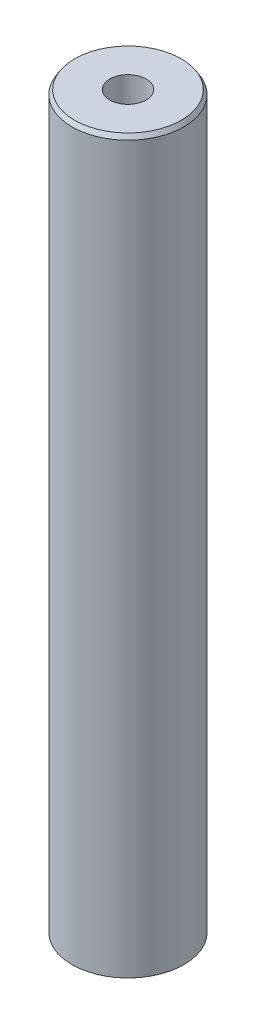
ISO-10303-21;
HEADER;
FILE_DESCRIPTION(('STEP AP214'),'2;1');
FILE_NAME('part.step','',(''),(''),'','','');
FILE_SCHEMA(('AUTOMOTIVE_DESIGN { 1 0 10303 214 1 1 1 1 }'));
ENDSEC;
DATA;
#1=APPLICATION_CONTEXT('core data for automotive mechanical design processes');
#2=APPLICATION_PROTOCOL_DEFINITION('international standard','automotive_design',2000,#1);
#3=PRODUCT_CONTEXT('',#1,'mechanical');
#4=PRODUCT('Part','Part','',(#3));
#5=PRODUCT_RELATED_PRODUCT_CATEGORY('part','',(#4));
#6=PRODUCT_DEFINITION_FORMATION('','',#4);
#7=PRODUCT_DEFINITION_CONTEXT('part definition',#1,'design');
#8=PRODUCT_DEFINITION('design','',#6,#7);
#9=PRODUCT_DEFINITION_SHAPE('','',#8);
#10=(LENGTH_UNIT() NAMED_UNIT(*) SI_UNIT(.MILLI.,.METRE.));
#11=(NAMED_UNIT(*) PLANE_ANGLE_UNIT() SI_UNIT($,.RADIAN.));
#12=(NAMED_UNIT(*) SI_UNIT($,.STERADIAN.) SOLID_ANGLE_UNIT());
#13=UNCERTAINTY_MEASURE_WITH_UNIT(LENGTH_MEASURE(1.E-05),#10,'distance_accuracy_value','');
#14=(GEOMETRIC_REPRESENTATION_CONTEXT(3) GLOBAL_UNCERTAINTY_ASSIGNED_CONTEXT((#13)) GLOBAL_UNIT_ASSIGNED_CONTEXT((#10,
#11,#12)) REPRESENTATION_CONTEXT('',''));
#15=CARTESIAN_POINT('',(0.,0.,0.));
#16=DIRECTION('',(0.,0.,1.));
#17=DIRECTION('',(1.,0.,0.));
#18=AXIS2_PLACEMENT_3D('',#15,#16,#17);
#19=CARTESIAN_POINT('',(0.,457.979607841957,0.));
#20=DIRECTION('',(0.,-1.,0.));
#21=DIRECTION('',(0.,0.,-1.));
#22=AXIS2_PLACEMENT_3D('',#19,#20,#21);
#23=CYLINDRICAL_SURFACE('',#22,35.);
#24=CARTESIAN_POINT('',(0.,455.256707147034,0.));
#25=DIRECTION('',(0.,1.,0.));
#26=DIRECTION('',(0.,0.,1.));
#27=AXIS2_PLACEMENT_3D('',#24,#25,#26);
#28=CIRCLE('',#27,35.);
#29=CARTESIAN_POINT('',(0.,455.256707147034,35.));
#30=VERTEX_POINT('',#29);
#31=EDGE_CURVE('E50',#30,#30,#28,.F.);
#32=ORIENTED_EDGE('',*,*,#31,.T.);
#33=EDGE_LOOP('',(#32));
#34=FACE_BOUND('',#33,.T.);
#35=CARTESIAN_POINT('',(0.,1.69080976443026,0.));
#36=DIRECTION('',(0.,1.,0.));
#37=DIRECTION('',(0.,0.,1.));
#38=AXIS2_PLACEMENT_3D('',#35,#36,#37);
#39=CIRCLE('',#38,35.);
#40=CARTESIAN_POINT('',(0.,1.69080976443026,35.));
#41=VERTEX_POINT('',#40);
#42=EDGE_CURVE('E51',#41,#41,#39,.T.);
#43=ORIENTED_EDGE('',*,*,#42,.T.);
#44=EDGE_LOOP('',(#43));
#45=FACE_BOUND('',#44,.T.);
#46=ADVANCED_FACE('F39',(#34,#45),#23,.T.);
#47=CARTESIAN_POINT('',(0.,457.979607841957,0.));
#48=DIRECTION('',(0.,1.,0.));
#49=DIRECTION('',(0.,0.,1.));
#50=AXIS2_PLACEMENT_3D('',#47,#48,#49);
#51=PLANE('',#50);
#52=CARTESIAN_POINT('',(0.,457.979607841957,0.));
#53=DIRECTION('',(0.,1.,0.));
#54=DIRECTION('',(0.,0.,1.));
#55=AXIS2_PLACEMENT_3D('',#52,#53,#54);
#56=CIRCLE('',#55,33.3091902355698);
#57=CARTESIAN_POINT('',(0.,457.979607841957,33.3091902355698));
#58=VERTEX_POINT('',#57);
#59=EDGE_CURVE('E54',#58,#58,#56,.T.);
#60=ORIENTED_EDGE('',*,*,#59,.T.);
#61=EDGE_LOOP('',(#60));
#62=FACE_BOUND('',#61,.T.);
#63=CARTESIAN_POINT('',(0.,457.979607841957,0.));
#64=DIRECTION('',(0.,1.,0.));
#65=DIRECTION('',(0.,0.,1.));
#66=AXIS2_PLACEMENT_3D('',#63,#64,#65);
#67=CIRCLE('',#66,11.3816435897316);
#68=CARTESIAN_POINT('',(0.,457.979607841957,11.3816435897316));
#69=VERTEX_POINT('',#68);
#70=EDGE_CURVE('E58',#69,#69,#67,.T.);
#71=ORIENTED_EDGE('',*,*,#70,.F.);
#72=EDGE_LOOP('',(#71));
#73=FACE_BOUND('',#72,.T.);
#74=ADVANCED_FACE('F69',(#62,#73),#51,.T.);
#75=CARTESIAN_POINT('',(0.,0.,0.));
#76=DIRECTION('',(0.,1.,0.));
#77=DIRECTION('',(0.,0.,1.));
#78=AXIS2_PLACEMENT_3D('',#75,#76,#77);
#79=PLANE('',#78);
#80=CARTESIAN_POINT('',(0.,0.,0.));
#81=DIRECTION('',(0.,1.,0.));
#82=DIRECTION('',(0.,0.,1.));
#83=AXIS2_PLACEMENT_3D('',#80,#81,#82);
#84=CIRCLE('',#83,32.2770993050772);
#85=CARTESIAN_POINT('',(0.,0.,32.2770993050772));
#86=VERTEX_POINT('',#85);
#87=EDGE_CURVE('E10',#86,#86,#84,.F.);
#88=ORIENTED_EDGE('',*,*,#87,.T.);
#89=EDGE_LOOP('',(#88));
#90=FACE_BOUND('',#89,.T.);
#91=CARTESIAN_POINT('',(0.,0.,0.));
#92=DIRECTION('',(0.,1.,0.));
#93=DIRECTION('',(0.,0.,1.));
#94=AXIS2_PLACEMENT_3D('',#91,#92,#93);
#95=CIRCLE('',#94,11.3816435897316);
#96=CARTESIAN_POINT('',(0.,0.,11.3816435897316));
#97=VERTEX_POINT('',#96);
#98=EDGE_CURVE('E63',#97,#97,#95,.T.);
#99=ORIENTED_EDGE('',*,*,#98,.T.);
#100=EDGE_LOOP('',(#99));
#101=FACE_BOUND('',#100,.T.);
#102=ADVANCED_FACE('F75',(#90,#101),#79,.F.);
#103=CARTESIAN_POINT('',(0.,457.979607841957,0.));
#104=DIRECTION('',(0.,-1.,0.));
#105=DIRECTION('',(0.,0.,-1.));
#106=AXIS2_PLACEMENT_3D('',#103,#104,#105);
#107=CYLINDRICAL_SURFACE('',#106,11.3816435897316);
#108=ORIENTED_EDGE('',*,*,#70,.T.);
#109=EDGE_LOOP('',(#108));
#110=FACE_BOUND('',#109,.T.);
#111=ORIENTED_EDGE('',*,*,#98,.F.);
#112=EDGE_LOOP('',(#111));
#113=FACE_BOUND('',#112,.T.);
#114=ADVANCED_FACE('F70',(#110,#113),#107,.F.);
#115=CARTESIAN_POINT('',(0.,457.979607841957,0.));
#116=DIRECTION('',(0.,-1.,0.));
#117=DIRECTION('',(0.,0.,-1.));
#118=AXIS2_PLACEMENT_3D('',#115,#116,#117);
#119=CONICAL_SURFACE('',#118,33.3091902355698,0.555688167744082);
#120=ORIENTED_EDGE('',*,*,#31,.F.);
#121=EDGE_LOOP('',(#120));
#122=FACE_BOUND('',#121,.T.);
#123=ORIENTED_EDGE('',*,*,#59,.F.);
#124=EDGE_LOOP('',(#123));
#125=FACE_BOUND('',#124,.T.);
#126=ADVANCED_FACE('F81',(#122,#125),#119,.T.);
#127=CARTESIAN_POINT('',(0.,1.69080976443026,0.));
#128=DIRECTION('',(0.,1.,0.));
#129=DIRECTION('',(0.,0.,1.));
#130=AXIS2_PLACEMENT_3D('',#127,#128,#129);
#131=CONICAL_SURFACE('',#130,35.,1.01510815905079);
#132=ORIENTED_EDGE('',*,*,#87,.F.);
#133=EDGE_LOOP('',(#132));
#134=FACE_BOUND('',#133,.T.);
#135=ORIENTED_EDGE('',*,*,#42,.F.);
#136=EDGE_LOOP('',(#135));
#137=FACE_BOUND('',#136,.T.);
#138=ADVANCED_FACE('F45',(#134,#137),#131,.T.);
#139=CLOSED_SHELL('',(#46,#74,#102,#114,#126,#138));
#140=MANIFOLD_SOLID_BREP('B2',#139);
#141=ADVANCED_BREP_SHAPE_REPRESENTATION('',(#18,#140),#14);
#142=SHAPE_DEFINITION_REPRESENTATION(#9,#141);
ENDSEC;
END-ISO-10303-21;
